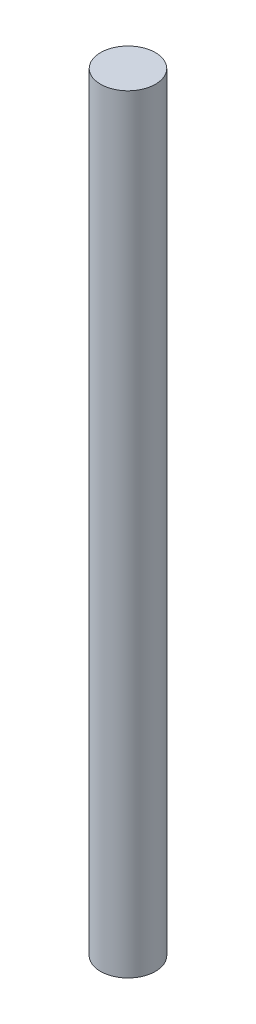
ISO-10303-21;
HEADER;
FILE_DESCRIPTION(('STEP AP214'),'2;1');
FILE_NAME('part.step','',(''),(''),'','','');
FILE_SCHEMA(('AUTOMOTIVE_DESIGN { 1 0 10303 214 1 1 1 1 }'));
ENDSEC;
DATA;
#1=APPLICATION_CONTEXT('core data for automotive mechanical design processes');
#2=APPLICATION_PROTOCOL_DEFINITION('international standard','automotive_design',2000,#1);
#3=PRODUCT_CONTEXT('',#1,'mechanical');
#4=PRODUCT('Part','Part','',(#3));
#5=PRODUCT_RELATED_PRODUCT_CATEGORY('part','',(#4));
#6=PRODUCT_DEFINITION_FORMATION('','',#4);
#7=PRODUCT_DEFINITION_CONTEXT('part definition',#1,'design');
#8=PRODUCT_DEFINITION('design','',#6,#7);
#9=PRODUCT_DEFINITION_SHAPE('','',#8);
#10=(LENGTH_UNIT() NAMED_UNIT(*) SI_UNIT(.MILLI.,.METRE.));
#11=(NAMED_UNIT(*) PLANE_ANGLE_UNIT() SI_UNIT($,.RADIAN.));
#12=(NAMED_UNIT(*) SI_UNIT($,.STERADIAN.) SOLID_ANGLE_UNIT());
#13=UNCERTAINTY_MEASURE_WITH_UNIT(LENGTH_MEASURE(1.E-05),#10,'distance_accuracy_value','');
#14=(GEOMETRIC_REPRESENTATION_CONTEXT(3) GLOBAL_UNCERTAINTY_ASSIGNED_CONTEXT((#13)) GLOBAL_UNIT_ASSIGNED_CONTEXT((#10,
#11,#12)) REPRESENTATION_CONTEXT('',''));
#15=CARTESIAN_POINT('',(0.,0.,0.));
#16=DIRECTION('',(0.,0.,1.));
#17=DIRECTION('',(1.,0.,0.));
#18=AXIS2_PLACEMENT_3D('',#15,#16,#17);
#19=CARTESIAN_POINT('',(0.,88.9,0.));
#20=DIRECTION('',(0.,-1.,0.));
#21=DIRECTION('',(0.,0.,-1.));
#22=AXIS2_PLACEMENT_3D('',#19,#20,#21);
#23=CYLINDRICAL_SURFACE('',#22,3.175);
#24=CARTESIAN_POINT('',(0.,88.9,0.));
#25=DIRECTION('',(0.,1.,0.));
#26=DIRECTION('',(0.,0.,1.));
#27=AXIS2_PLACEMENT_3D('',#24,#25,#26);
#28=CIRCLE('',#27,3.175);
#29=CARTESIAN_POINT('',(0.,88.9,3.175));
#30=VERTEX_POINT('',#29);
#31=EDGE_CURVE('E10',#30,#30,#28,.T.);
#32=ORIENTED_EDGE('',*,*,#31,.F.);
#33=EDGE_LOOP('',(#32));
#34=FACE_BOUND('',#33,.T.);
#35=CARTESIAN_POINT('',(0.,0.,0.));
#36=DIRECTION('',(0.,1.,0.));
#37=DIRECTION('',(0.,0.,1.));
#38=AXIS2_PLACEMENT_3D('',#35,#36,#37);
#39=CIRCLE('',#38,3.175);
#40=CARTESIAN_POINT('',(0.,0.,3.175));
#41=VERTEX_POINT('',#40);
#42=EDGE_CURVE('E33',#41,#41,#39,.T.);
#43=ORIENTED_EDGE('',*,*,#42,.T.);
#44=EDGE_LOOP('',(#43));
#45=FACE_BOUND('',#44,.T.);
#46=ADVANCED_FACE('F30',(#34,#45),#23,.T.);
#47=CARTESIAN_POINT('',(0.,88.9,0.));
#48=DIRECTION('',(0.,1.,0.));
#49=DIRECTION('',(0.,0.,1.));
#50=AXIS2_PLACEMENT_3D('',#47,#48,#49);
#51=PLANE('',#50);
#52=ORIENTED_EDGE('',*,*,#31,.T.);
#53=EDGE_LOOP('',(#52));
#54=FACE_BOUND('',#53,.T.);
#55=ADVANCED_FACE('F45',(#54),#51,.T.);
#56=CARTESIAN_POINT('',(0.,0.,0.));
#57=DIRECTION('',(0.,1.,0.));
#58=DIRECTION('',(0.,0.,1.));
#59=AXIS2_PLACEMENT_3D('',#56,#57,#58);
#60=PLANE('',#59);
#61=ORIENTED_EDGE('',*,*,#42,.F.);
#62=EDGE_LOOP('',(#61));
#63=FACE_BOUND('',#62,.T.);
#64=ADVANCED_FACE('F43',(#63),#60,.F.);
#65=CLOSED_SHELL('',(#46,#55,#64));
#66=MANIFOLD_SOLID_BREP('B2',#65);
#67=ADVANCED_BREP_SHAPE_REPRESENTATION('',(#18,#66),#14);
#68=SHAPE_DEFINITION_REPRESENTATION(#9,#67);
ENDSEC;
END-ISO-10303-21;
